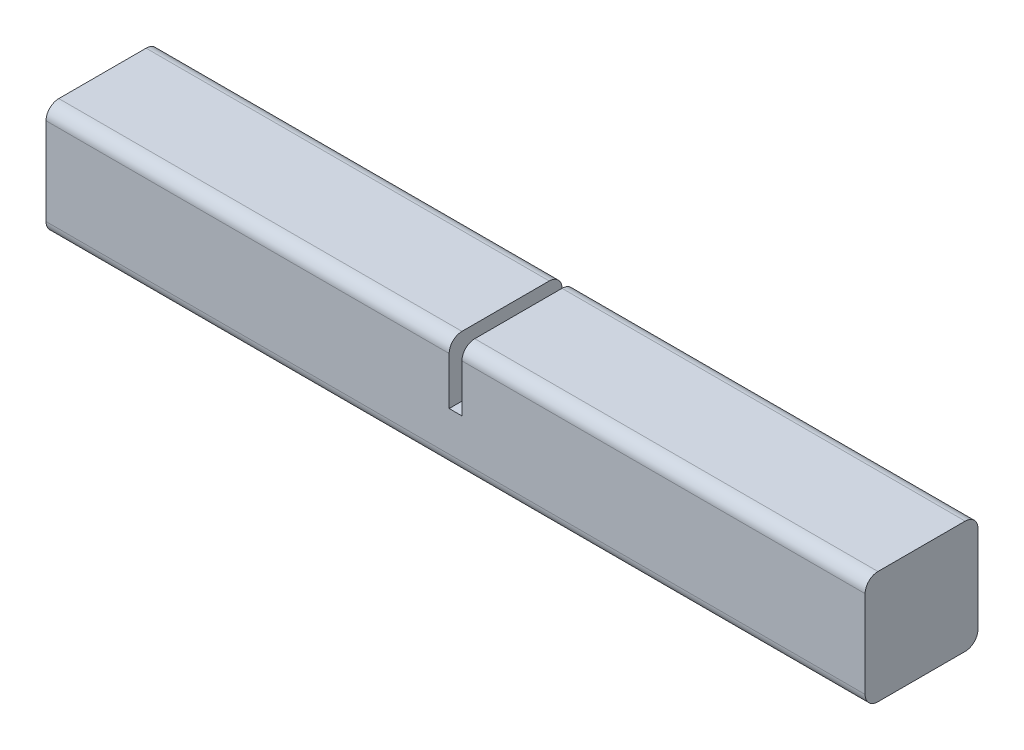
ISO-10303-21;
HEADER;
FILE_DESCRIPTION(('STEP AP214'),'2;1');
FILE_NAME('part.step','',(''),(''),'','','');
FILE_SCHEMA(('AUTOMOTIVE_DESIGN { 1 0 10303 214 1 1 1 1 }'));
ENDSEC;
DATA;
#1=APPLICATION_CONTEXT('core data for automotive mechanical design processes');
#2=APPLICATION_PROTOCOL_DEFINITION('international standard','automotive_design',2000,#1);
#3=PRODUCT_CONTEXT('',#1,'mechanical');
#4=PRODUCT('Part','Part','',(#3));
#5=PRODUCT_RELATED_PRODUCT_CATEGORY('part','',(#4));
#6=PRODUCT_DEFINITION_FORMATION('','',#4);
#7=PRODUCT_DEFINITION_CONTEXT('part definition',#1,'design');
#8=PRODUCT_DEFINITION('design','',#6,#7);
#9=PRODUCT_DEFINITION_SHAPE('','',#8);
#10=(LENGTH_UNIT() NAMED_UNIT(*) SI_UNIT(.MILLI.,.METRE.));
#11=(NAMED_UNIT(*) PLANE_ANGLE_UNIT() SI_UNIT($,.RADIAN.));
#12=(NAMED_UNIT(*) SI_UNIT($,.STERADIAN.) SOLID_ANGLE_UNIT());
#13=UNCERTAINTY_MEASURE_WITH_UNIT(LENGTH_MEASURE(1.E-05),#10,'distance_accuracy_value','');
#14=(GEOMETRIC_REPRESENTATION_CONTEXT(3) GLOBAL_UNCERTAINTY_ASSIGNED_CONTEXT((#13)) GLOBAL_UNIT_ASSIGNED_CONTEXT((#10,
#11,#12)) REPRESENTATION_CONTEXT('',''));
#15=CARTESIAN_POINT('',(0.,0.,0.));
#16=DIRECTION('',(0.,0.,1.));
#17=DIRECTION('',(1.,0.,0.));
#18=AXIS2_PLACEMENT_3D('',#15,#16,#17);
#19=CARTESIAN_POINT('',(203.2,14.,-14.));
#20=DIRECTION('',(0.,-1.,0.));
#21=DIRECTION('',(0.,0.,-1.));
#22=AXIS2_PLACEMENT_3D('',#19,#20,#21);
#23=PLANE('',#22);
#24=DIRECTION('',(0.,0.,1.));
#25=VECTOR('',#24,1.);
#26=CARTESIAN_POINT('',(100.0125,14.,-14.));
#27=LINE('',#26,#25);
#28=CARTESIAN_POINT('',(100.0125,14.,-10.825));
#29=VERTEX_POINT('',#28);
#30=CARTESIAN_POINT('',(100.0125,14.,10.825));
#31=VERTEX_POINT('',#30);
#32=EDGE_CURVE('E164',#29,#31,#27,.T.);
#33=ORIENTED_EDGE('',*,*,#32,.F.);
#34=DIRECTION('',(-1.,0.,0.));
#35=VECTOR('',#34,1.);
#36=CARTESIAN_POINT('',(203.2,14.,-10.825));
#37=LINE('',#36,#35);
#38=CARTESIAN_POINT('',(0.,14.,-10.825));
#39=VERTEX_POINT('',#38);
#40=EDGE_CURVE('E240',#29,#39,#37,.T.);
#41=ORIENTED_EDGE('',*,*,#40,.T.);
#42=DIRECTION('',(0.,0.,1.));
#43=VECTOR('',#42,1.);
#44=CARTESIAN_POINT('',(0.,14.,-14.));
#45=LINE('',#44,#43);
#46=CARTESIAN_POINT('',(0.,14.,10.825));
#47=VERTEX_POINT('',#46);
#48=EDGE_CURVE('E179',#39,#47,#45,.T.);
#49=ORIENTED_EDGE('',*,*,#48,.T.);
#50=DIRECTION('',(-1.,0.,0.));
#51=VECTOR('',#50,1.);
#52=CARTESIAN_POINT('',(203.2,14.,10.825));
#53=LINE('',#52,#51);
#54=EDGE_CURVE('E48',#47,#31,#53,.F.);
#55=ORIENTED_EDGE('',*,*,#54,.T.);
#56=EDGE_LOOP('',(#33,#41,#49,#55));
#57=FACE_BOUND('',#56,.T.);
#58=ADVANCED_FACE('F33',(#57),#23,.F.);
#59=CARTESIAN_POINT('',(203.2,-14.,14.));
#60=DIRECTION('',(0.,0.,-1.));
#61=DIRECTION('',(-1.,0.,0.));
#62=AXIS2_PLACEMENT_3D('',#59,#60,#61);
#63=PLANE('',#62);
#64=DIRECTION('',(0.,-1.,0.));
#65=VECTOR('',#64,1.);
#66=CARTESIAN_POINT('',(0.,-14.,14.));
#67=LINE('',#66,#65);
#68=CARTESIAN_POINT('',(0.,10.825,14.));
#69=VERTEX_POINT('',#68);
#70=CARTESIAN_POINT('',(0.,-10.825,14.));
#71=VERTEX_POINT('',#70);
#72=EDGE_CURVE('E170',#69,#71,#67,.T.);
#73=ORIENTED_EDGE('',*,*,#72,.T.);
#74=DIRECTION('',(-1.,0.,0.));
#75=VECTOR('',#74,1.);
#76=CARTESIAN_POINT('',(203.2,-10.825,14.));
#77=LINE('',#76,#75);
#78=CARTESIAN_POINT('',(203.2,-10.825,14.));
#79=VERTEX_POINT('',#78);
#80=EDGE_CURVE('E228',#71,#79,#77,.F.);
#81=ORIENTED_EDGE('',*,*,#80,.T.);
#82=DIRECTION('',(0.,-1.,0.));
#83=VECTOR('',#82,1.);
#84=CARTESIAN_POINT('',(203.2,-14.,14.));
#85=LINE('',#84,#83);
#86=CARTESIAN_POINT('',(203.2,10.825,14.));
#87=VERTEX_POINT('',#86);
#88=EDGE_CURVE('E175',#87,#79,#85,.T.);
#89=ORIENTED_EDGE('',*,*,#88,.F.);
#90=DIRECTION('',(-1.,0.,0.));
#91=VECTOR('',#90,1.);
#92=CARTESIAN_POINT('',(203.2,10.825,14.));
#93=LINE('',#92,#91);
#94=CARTESIAN_POINT('',(103.1875,10.825,14.));
#95=VERTEX_POINT('',#94);
#96=EDGE_CURVE('E226',#87,#95,#93,.T.);
#97=ORIENTED_EDGE('',*,*,#96,.T.);
#98=DIRECTION('',(0.,1.,0.));
#99=VECTOR('',#98,1.);
#100=CARTESIAN_POINT('',(103.1875,-1.,14.));
#101=LINE('',#100,#99);
#102=CARTESIAN_POINT('',(103.1875,-1.,14.));
#103=VERTEX_POINT('',#102);
#104=EDGE_CURVE('E142',#103,#95,#101,.T.);
#105=ORIENTED_EDGE('',*,*,#104,.F.);
#106=DIRECTION('',(1.,0.,0.));
#107=VECTOR('',#106,1.);
#108=CARTESIAN_POINT('',(100.0125,-1.,14.));
#109=LINE('',#108,#107);
#110=CARTESIAN_POINT('',(100.0125,-1.,14.));
#111=VERTEX_POINT('',#110);
#112=EDGE_CURVE('E149',#111,#103,#109,.T.);
#113=ORIENTED_EDGE('',*,*,#112,.F.);
#114=DIRECTION('',(0.,1.,0.));
#115=VECTOR('',#114,1.);
#116=CARTESIAN_POINT('',(100.0125,-1.,14.));
#117=LINE('',#116,#115);
#118=CARTESIAN_POINT('',(100.0125,10.825,14.));
#119=VERTEX_POINT('',#118);
#120=EDGE_CURVE('E132',#111,#119,#117,.T.);
#121=ORIENTED_EDGE('',*,*,#120,.T.);
#122=DIRECTION('',(-1.,0.,0.));
#123=VECTOR('',#122,1.);
#124=CARTESIAN_POINT('',(203.2,10.825,14.));
#125=LINE('',#124,#123);
#126=EDGE_CURVE('E224',#119,#69,#125,.T.);
#127=ORIENTED_EDGE('',*,*,#126,.T.);
#128=EDGE_LOOP('',(#73,#81,#89,#97,#105,#113,#121,#127));
#129=FACE_BOUND('',#128,.T.);
#130=ADVANCED_FACE('F156',(#129),#63,.F.);
#131=CARTESIAN_POINT('',(203.2,-14.,-14.));
#132=DIRECTION('',(0.,1.,0.));
#133=DIRECTION('',(0.,0.,1.));
#134=AXIS2_PLACEMENT_3D('',#131,#132,#133);
#135=PLANE('',#134);
#136=DIRECTION('',(0.,0.,-1.));
#137=VECTOR('',#136,1.);
#138=CARTESIAN_POINT('',(0.,-14.,-14.));
#139=LINE('',#138,#137);
#140=CARTESIAN_POINT('',(0.,-14.,10.825));
#141=VERTEX_POINT('',#140);
#142=CARTESIAN_POINT('',(0.,-14.,-10.825));
#143=VERTEX_POINT('',#142);
#144=EDGE_CURVE('E190',#141,#143,#139,.T.);
#145=ORIENTED_EDGE('',*,*,#144,.T.);
#146=DIRECTION('',(-1.,0.,0.));
#147=VECTOR('',#146,1.);
#148=CARTESIAN_POINT('',(203.2,-14.,-10.825));
#149=LINE('',#148,#147);
#150=CARTESIAN_POINT('',(203.2,-14.,-10.825));
#151=VERTEX_POINT('',#150);
#152=EDGE_CURVE('E214',#143,#151,#149,.F.);
#153=ORIENTED_EDGE('',*,*,#152,.T.);
#154=DIRECTION('',(0.,0.,-1.));
#155=VECTOR('',#154,1.);
#156=CARTESIAN_POINT('',(203.2,-14.,-14.));
#157=LINE('',#156,#155);
#158=CARTESIAN_POINT('',(203.2,-14.,10.825));
#159=VERTEX_POINT('',#158);
#160=EDGE_CURVE('E178',#159,#151,#157,.T.);
#161=ORIENTED_EDGE('',*,*,#160,.F.);
#162=DIRECTION('',(-1.,0.,0.));
#163=VECTOR('',#162,1.);
#164=CARTESIAN_POINT('',(203.2,-14.,10.825));
#165=LINE('',#164,#163);
#166=EDGE_CURVE('E211',#159,#141,#165,.T.);
#167=ORIENTED_EDGE('',*,*,#166,.T.);
#168=EDGE_LOOP('',(#145,#153,#161,#167));
#169=FACE_BOUND('',#168,.T.);
#170=ADVANCED_FACE('F261',(#169),#135,.F.);
#171=CARTESIAN_POINT('',(203.2,-14.,-14.));
#172=DIRECTION('',(0.,0.,1.));
#173=DIRECTION('',(1.,0.,0.));
#174=AXIS2_PLACEMENT_3D('',#171,#172,#173);
#175=PLANE('',#174);
#176=DIRECTION('',(0.,1.,0.));
#177=VECTOR('',#176,1.);
#178=CARTESIAN_POINT('',(203.2,-14.,-14.));
#179=LINE('',#178,#177);
#180=CARTESIAN_POINT('',(203.2,-10.825,-14.));
#181=VERTEX_POINT('',#180);
#182=CARTESIAN_POINT('',(203.2,10.825,-14.));
#183=VERTEX_POINT('',#182);
#184=EDGE_CURVE('E182',#181,#183,#179,.T.);
#185=ORIENTED_EDGE('',*,*,#184,.F.);
#186=DIRECTION('',(-1.,0.,0.));
#187=VECTOR('',#186,1.);
#188=CARTESIAN_POINT('',(203.2,-10.825,-14.));
#189=LINE('',#188,#187);
#190=CARTESIAN_POINT('',(0.,-10.825,-14.));
#191=VERTEX_POINT('',#190);
#192=EDGE_CURVE('E200',#181,#191,#189,.T.);
#193=ORIENTED_EDGE('',*,*,#192,.T.);
#194=DIRECTION('',(0.,1.,0.));
#195=VECTOR('',#194,1.);
#196=CARTESIAN_POINT('',(0.,-14.,-14.));
#197=LINE('',#196,#195);
#198=CARTESIAN_POINT('',(0.,10.825,-14.));
#199=VERTEX_POINT('',#198);
#200=EDGE_CURVE('E193',#191,#199,#197,.T.);
#201=ORIENTED_EDGE('',*,*,#200,.T.);
#202=DIRECTION('',(-1.,0.,0.));
#203=VECTOR('',#202,1.);
#204=CARTESIAN_POINT('',(203.2,10.825,-14.));
#205=LINE('',#204,#203);
#206=CARTESIAN_POINT('',(100.0125,10.825,-14.));
#207=VERTEX_POINT('',#206);
#208=EDGE_CURVE('E188',#199,#207,#205,.F.);
#209=ORIENTED_EDGE('',*,*,#208,.T.);
#210=DIRECTION('',(0.,1.,0.));
#211=VECTOR('',#210,1.);
#212=CARTESIAN_POINT('',(100.0125,-0.999999999999999,-14.));
#213=LINE('',#212,#211);
#214=CARTESIAN_POINT('',(100.0125,-0.999999999999999,-14.));
#215=VERTEX_POINT('',#214);
#216=EDGE_CURVE('E168',#215,#207,#213,.T.);
#217=ORIENTED_EDGE('',*,*,#216,.F.);
#218=DIRECTION('',(-1.,0.,0.));
#219=VECTOR('',#218,1.);
#220=CARTESIAN_POINT('',(100.0125,-0.999999999999999,-14.));
#221=LINE('',#220,#219);
#222=CARTESIAN_POINT('',(103.1875,-0.999999999999999,-14.));
#223=VERTEX_POINT('',#222);
#224=EDGE_CURVE('E143',#223,#215,#221,.T.);
#225=ORIENTED_EDGE('',*,*,#224,.F.);
#226=DIRECTION('',(0.,1.,0.));
#227=VECTOR('',#226,1.);
#228=CARTESIAN_POINT('',(103.1875,-0.999999999999999,-14.));
#229=LINE('',#228,#227);
#230=CARTESIAN_POINT('',(103.1875,10.825,-14.));
#231=VERTEX_POINT('',#230);
#232=EDGE_CURVE('E171',#223,#231,#229,.T.);
#233=ORIENTED_EDGE('',*,*,#232,.T.);
#234=DIRECTION('',(-1.,0.,0.));
#235=VECTOR('',#234,1.);
#236=CARTESIAN_POINT('',(203.2,10.825,-14.));
#237=LINE('',#236,#235);
#238=EDGE_CURVE('E198',#231,#183,#237,.F.);
#239=ORIENTED_EDGE('',*,*,#238,.T.);
#240=EDGE_LOOP('',(#185,#193,#201,#209,#217,#225,#233,#239));
#241=FACE_BOUND('',#240,.T.);
#242=ADVANCED_FACE('F270',(#241),#175,.F.);
#243=DIRECTION('',(0.,0.,-1.));
#244=VECTOR('',#243,1.);
#245=CARTESIAN_POINT('',(103.1875,14.,-14.));
#246=LINE('',#245,#244);
#247=CARTESIAN_POINT('',(103.1875,14.,10.825));
#248=VERTEX_POINT('',#247);
#249=CARTESIAN_POINT('',(103.1875,14.,-10.825));
#250=VERTEX_POINT('',#249);
#251=EDGE_CURVE('E153',#248,#250,#246,.T.);
#252=ORIENTED_EDGE('',*,*,#251,.F.);
#253=DIRECTION('',(-1.,0.,0.));
#254=VECTOR('',#253,1.);
#255=CARTESIAN_POINT('',(203.2,14.,10.825));
#256=LINE('',#255,#254);
#257=CARTESIAN_POINT('',(203.2,14.,10.825));
#258=VERTEX_POINT('',#257);
#259=EDGE_CURVE('E237',#248,#258,#256,.F.);
#260=ORIENTED_EDGE('',*,*,#259,.T.);
#261=DIRECTION('',(0.,0.,1.));
#262=VECTOR('',#261,1.);
#263=CARTESIAN_POINT('',(203.2,14.,-14.));
#264=LINE('',#263,#262);
#265=CARTESIAN_POINT('',(203.2,14.,-10.825));
#266=VERTEX_POINT('',#265);
#267=EDGE_CURVE('E185',#266,#258,#264,.T.);
#268=ORIENTED_EDGE('',*,*,#267,.F.);
#269=DIRECTION('',(-1.,0.,0.));
#270=VECTOR('',#269,1.);
#271=CARTESIAN_POINT('',(203.2,14.,-10.825));
#272=LINE('',#271,#270);
#273=EDGE_CURVE('E234',#266,#250,#272,.T.);
#274=ORIENTED_EDGE('',*,*,#273,.T.);
#275=EDGE_LOOP('',(#252,#260,#268,#274));
#276=FACE_BOUND('',#275,.T.);
#277=ADVANCED_FACE('F279',(#276),#23,.F.);
#278=CARTESIAN_POINT('',(203.2,0.,0.));
#279=DIRECTION('',(1.,0.,0.));
#280=DIRECTION('',(0.,0.,-1.));
#281=AXIS2_PLACEMENT_3D('',#278,#279,#280);
#282=PLANE('',#281);
#283=ORIENTED_EDGE('',*,*,#160,.T.);
#284=CARTESIAN_POINT('',(203.2,-10.825,-10.825));
#285=DIRECTION('',(1.,0.,0.));
#286=DIRECTION('',(0.,0.,-1.));
#287=AXIS2_PLACEMENT_3D('',#284,#285,#286);
#288=CIRCLE('',#287,3.175);
#289=EDGE_CURVE('E222',#151,#181,#288,.T.);
#290=ORIENTED_EDGE('',*,*,#289,.T.);
#291=ORIENTED_EDGE('',*,*,#184,.T.);
#292=CARTESIAN_POINT('',(203.2,10.825,-10.825));
#293=DIRECTION('',(1.,0.,0.));
#294=DIRECTION('',(0.,0.,-1.));
#295=AXIS2_PLACEMENT_3D('',#292,#293,#294);
#296=CIRCLE('',#295,3.175);
#297=EDGE_CURVE('E216',#183,#266,#296,.T.);
#298=ORIENTED_EDGE('',*,*,#297,.T.);
#299=ORIENTED_EDGE('',*,*,#267,.T.);
#300=CARTESIAN_POINT('',(203.2,10.825,10.825));
#301=DIRECTION('',(1.,0.,0.));
#302=DIRECTION('',(0.,0.,-1.));
#303=AXIS2_PLACEMENT_3D('',#300,#301,#302);
#304=CIRCLE('',#303,3.175);
#305=EDGE_CURVE('E218',#258,#87,#304,.T.);
#306=ORIENTED_EDGE('',*,*,#305,.T.);
#307=ORIENTED_EDGE('',*,*,#88,.T.);
#308=CARTESIAN_POINT('',(203.2,-10.825,10.825));
#309=DIRECTION('',(1.,0.,0.));
#310=DIRECTION('',(0.,0.,-1.));
#311=AXIS2_PLACEMENT_3D('',#308,#309,#310);
#312=CIRCLE('',#311,3.175);
#313=EDGE_CURVE('E220',#79,#159,#312,.T.);
#314=ORIENTED_EDGE('',*,*,#313,.T.);
#315=EDGE_LOOP('',(#283,#290,#291,#298,#299,#306,#307,#314));
#316=FACE_BOUND('',#315,.T.);
#317=ADVANCED_FACE('F258',(#316),#282,.T.);
#318=CARTESIAN_POINT('',(0.,0.,0.));
#319=DIRECTION('',(1.,0.,0.));
#320=DIRECTION('',(0.,0.,-1.));
#321=AXIS2_PLACEMENT_3D('',#318,#319,#320);
#322=PLANE('',#321);
#323=ORIENTED_EDGE('',*,*,#200,.F.);
#324=CARTESIAN_POINT('',(0.,-10.825,-10.825));
#325=DIRECTION('',(1.,0.,0.));
#326=DIRECTION('',(0.,0.,-1.));
#327=AXIS2_PLACEMENT_3D('',#324,#325,#326);
#328=CIRCLE('',#327,3.175);
#329=EDGE_CURVE('E209',#191,#143,#328,.F.);
#330=ORIENTED_EDGE('',*,*,#329,.T.);
#331=ORIENTED_EDGE('',*,*,#144,.F.);
#332=CARTESIAN_POINT('',(0.,-10.825,10.825));
#333=DIRECTION('',(1.,0.,0.));
#334=DIRECTION('',(0.,0.,-1.));
#335=AXIS2_PLACEMENT_3D('',#332,#333,#334);
#336=CIRCLE('',#335,3.175);
#337=EDGE_CURVE('E207',#141,#71,#336,.F.);
#338=ORIENTED_EDGE('',*,*,#337,.T.);
#339=ORIENTED_EDGE('',*,*,#72,.F.);
#340=CARTESIAN_POINT('',(0.,10.825,10.825));
#341=DIRECTION('',(1.,0.,0.));
#342=DIRECTION('',(0.,0.,-1.));
#343=AXIS2_PLACEMENT_3D('',#340,#341,#342);
#344=CIRCLE('',#343,3.175);
#345=EDGE_CURVE('E203',#69,#47,#344,.F.);
#346=ORIENTED_EDGE('',*,*,#345,.T.);
#347=ORIENTED_EDGE('',*,*,#48,.F.);
#348=CARTESIAN_POINT('',(0.,10.825,-10.825));
#349=DIRECTION('',(1.,0.,0.));
#350=DIRECTION('',(0.,0.,-1.));
#351=AXIS2_PLACEMENT_3D('',#348,#349,#350);
#352=CIRCLE('',#351,3.175);
#353=EDGE_CURVE('E205',#39,#199,#352,.F.);
#354=ORIENTED_EDGE('',*,*,#353,.T.);
#355=EDGE_LOOP('',(#323,#330,#331,#338,#339,#346,#347,#354));
#356=FACE_BOUND('',#355,.T.);
#357=ADVANCED_FACE('F247',(#356),#322,.F.);
#358=CARTESIAN_POINT('',(100.0125,-0.999999999999999,-14.));
#359=DIRECTION('',(-1.,0.,0.));
#360=DIRECTION('',(0.,0.,1.));
#361=AXIS2_PLACEMENT_3D('',#358,#359,#360);
#362=PLANE('',#361);
#363=ORIENTED_EDGE('',*,*,#216,.T.);
#364=CARTESIAN_POINT('',(100.0125,10.825,-10.825));
#365=DIRECTION('',(-1.,0.,0.));
#366=DIRECTION('',(0.,0.,1.));
#367=AXIS2_PLACEMENT_3D('',#364,#365,#366);
#368=CIRCLE('',#367,3.175);
#369=EDGE_CURVE('E11',#207,#29,#368,.F.);
#370=ORIENTED_EDGE('',*,*,#369,.T.);
#371=ORIENTED_EDGE('',*,*,#32,.T.);
#372=CARTESIAN_POINT('',(100.0125,10.825,10.825));
#373=DIRECTION('',(-1.,0.,0.));
#374=DIRECTION('',(0.,0.,1.));
#375=AXIS2_PLACEMENT_3D('',#372,#373,#374);
#376=CIRCLE('',#375,3.175);
#377=EDGE_CURVE('E41',#31,#119,#376,.F.);
#378=ORIENTED_EDGE('',*,*,#377,.T.);
#379=ORIENTED_EDGE('',*,*,#120,.F.);
#380=DIRECTION('',(0.,0.,1.));
#381=VECTOR('',#380,1.);
#382=CARTESIAN_POINT('',(100.0125,-0.999999999999999,-14.));
#383=LINE('',#382,#381);
#384=EDGE_CURVE('E135',#215,#111,#383,.T.);
#385=ORIENTED_EDGE('',*,*,#384,.F.);
#386=EDGE_LOOP('',(#363,#370,#371,#378,#379,#385));
#387=FACE_BOUND('',#386,.T.);
#388=ADVANCED_FACE('F134',(#387),#362,.F.);
#389=CARTESIAN_POINT('',(103.1875,-0.999999999999999,-14.));
#390=DIRECTION('',(1.,0.,0.));
#391=DIRECTION('',(0.,0.,-1.));
#392=AXIS2_PLACEMENT_3D('',#389,#390,#391);
#393=PLANE('',#392);
#394=ORIENTED_EDGE('',*,*,#104,.T.);
#395=CARTESIAN_POINT('',(103.1875,10.825,10.825));
#396=DIRECTION('',(1.,0.,0.));
#397=DIRECTION('',(0.,0.,-1.));
#398=AXIS2_PLACEMENT_3D('',#395,#396,#397);
#399=CIRCLE('',#398,3.175);
#400=EDGE_CURVE('E232',#95,#248,#399,.F.);
#401=ORIENTED_EDGE('',*,*,#400,.T.);
#402=ORIENTED_EDGE('',*,*,#251,.T.);
#403=CARTESIAN_POINT('',(103.1875,10.825,-10.825));
#404=DIRECTION('',(1.,0.,0.));
#405=DIRECTION('',(0.,0.,-1.));
#406=AXIS2_PLACEMENT_3D('',#403,#404,#405);
#407=CIRCLE('',#406,3.175);
#408=EDGE_CURVE('E230',#250,#231,#407,.F.);
#409=ORIENTED_EDGE('',*,*,#408,.T.);
#410=ORIENTED_EDGE('',*,*,#232,.F.);
#411=DIRECTION('',(0.,0.,-1.));
#412=VECTOR('',#411,1.);
#413=CARTESIAN_POINT('',(103.1875,-0.999999999999999,-14.));
#414=LINE('',#413,#412);
#415=EDGE_CURVE('E159',#103,#223,#414,.T.);
#416=ORIENTED_EDGE('',*,*,#415,.F.);
#417=EDGE_LOOP('',(#394,#401,#402,#409,#410,#416));
#418=FACE_BOUND('',#417,.T.);
#419=ADVANCED_FACE('F285',(#418),#393,.F.);
#420=CARTESIAN_POINT('',(0.,-1.,0.));
#421=DIRECTION('',(0.,1.,0.));
#422=DIRECTION('',(0.,0.,1.));
#423=AXIS2_PLACEMENT_3D('',#420,#421,#422);
#424=PLANE('',#423);
#425=ORIENTED_EDGE('',*,*,#384,.T.);
#426=ORIENTED_EDGE('',*,*,#112,.T.);
#427=ORIENTED_EDGE('',*,*,#415,.T.);
#428=ORIENTED_EDGE('',*,*,#224,.T.);
#429=EDGE_LOOP('',(#425,#426,#427,#428));
#430=FACE_BOUND('',#429,.T.);
#431=ADVANCED_FACE('F147',(#430),#424,.T.);
#432=CARTESIAN_POINT('',(203.2,-10.825,-10.825));
#433=DIRECTION('',(-1.,0.,0.));
#434=DIRECTION('',(0.,0.,1.));
#435=AXIS2_PLACEMENT_3D('',#432,#433,#434);
#436=CYLINDRICAL_SURFACE('',#435,3.175);
#437=ORIENTED_EDGE('',*,*,#289,.F.);
#438=ORIENTED_EDGE('',*,*,#152,.F.);
#439=ORIENTED_EDGE('',*,*,#329,.F.);
#440=ORIENTED_EDGE('',*,*,#192,.F.);
#441=EDGE_LOOP('',(#437,#438,#439,#440));
#442=FACE_BOUND('',#441,.T.);
#443=ADVANCED_FACE('F265',(#442),#436,.T.);
#444=CARTESIAN_POINT('',(203.2,-10.825,10.825));
#445=DIRECTION('',(-1.,0.,0.));
#446=DIRECTION('',(0.,0.,1.));
#447=AXIS2_PLACEMENT_3D('',#444,#445,#446);
#448=CYLINDRICAL_SURFACE('',#447,3.175);
#449=ORIENTED_EDGE('',*,*,#313,.F.);
#450=ORIENTED_EDGE('',*,*,#80,.F.);
#451=ORIENTED_EDGE('',*,*,#337,.F.);
#452=ORIENTED_EDGE('',*,*,#166,.F.);
#453=EDGE_LOOP('',(#449,#450,#451,#452));
#454=FACE_BOUND('',#453,.T.);
#455=ADVANCED_FACE('F254',(#454),#448,.T.);
#456=CARTESIAN_POINT('',(203.2,10.825,10.825));
#457=DIRECTION('',(-1.,0.,0.));
#458=DIRECTION('',(0.,0.,1.));
#459=AXIS2_PLACEMENT_3D('',#456,#457,#458);
#460=CYLINDRICAL_SURFACE('',#459,3.175);
#461=ORIENTED_EDGE('',*,*,#305,.F.);
#462=ORIENTED_EDGE('',*,*,#259,.F.);
#463=ORIENTED_EDGE('',*,*,#400,.F.);
#464=ORIENTED_EDGE('',*,*,#96,.F.);
#465=EDGE_LOOP('',(#461,#462,#463,#464));
#466=FACE_BOUND('',#465,.T.);
#467=ADVANCED_FACE('F282',(#466),#460,.T.);
#468=CARTESIAN_POINT('',(203.2,10.825,-10.825));
#469=DIRECTION('',(-1.,0.,0.));
#470=DIRECTION('',(0.,0.,1.));
#471=AXIS2_PLACEMENT_3D('',#468,#469,#470);
#472=CYLINDRICAL_SURFACE('',#471,3.175);
#473=ORIENTED_EDGE('',*,*,#297,.F.);
#474=ORIENTED_EDGE('',*,*,#238,.F.);
#475=ORIENTED_EDGE('',*,*,#408,.F.);
#476=ORIENTED_EDGE('',*,*,#273,.F.);
#477=EDGE_LOOP('',(#473,#474,#475,#476));
#478=FACE_BOUND('',#477,.T.);
#479=ADVANCED_FACE('F273',(#478),#472,.T.);
#480=CARTESIAN_POINT('',(203.2,10.825,-10.825));
#481=DIRECTION('',(-1.,0.,0.));
#482=DIRECTION('',(0.,0.,1.));
#483=AXIS2_PLACEMENT_3D('',#480,#481,#482);
#484=CYLINDRICAL_SURFACE('',#483,3.175);
#485=ORIENTED_EDGE('',*,*,#369,.F.);
#486=ORIENTED_EDGE('',*,*,#208,.F.);
#487=ORIENTED_EDGE('',*,*,#353,.F.);
#488=ORIENTED_EDGE('',*,*,#40,.F.);
#489=EDGE_LOOP('',(#485,#486,#487,#488));
#490=FACE_BOUND('',#489,.T.);
#491=ADVANCED_FACE('F287',(#490),#484,.T.);
#492=CARTESIAN_POINT('',(203.2,10.825,10.825));
#493=DIRECTION('',(-1.,0.,0.));
#494=DIRECTION('',(0.,0.,1.));
#495=AXIS2_PLACEMENT_3D('',#492,#493,#494);
#496=CYLINDRICAL_SURFACE('',#495,3.175);
#497=ORIENTED_EDGE('',*,*,#377,.F.);
#498=ORIENTED_EDGE('',*,*,#54,.F.);
#499=ORIENTED_EDGE('',*,*,#345,.F.);
#500=ORIENTED_EDGE('',*,*,#126,.F.);
#501=EDGE_LOOP('',(#497,#498,#499,#500));
#502=FACE_BOUND('',#501,.T.);
#503=ADVANCED_FACE('F35',(#502),#496,.T.);
#504=CLOSED_SHELL('',(#58,#130,#170,#242,#277,#317,#357,#388,#419,#431,#443,#455,#467,#479,#491,#503));
#505=MANIFOLD_SOLID_BREP('B2',#504);
#506=ADVANCED_BREP_SHAPE_REPRESENTATION('',(#18,#505),#14);
#507=SHAPE_DEFINITION_REPRESENTATION(#9,#506);
ENDSEC;
END-ISO-10303-21;
